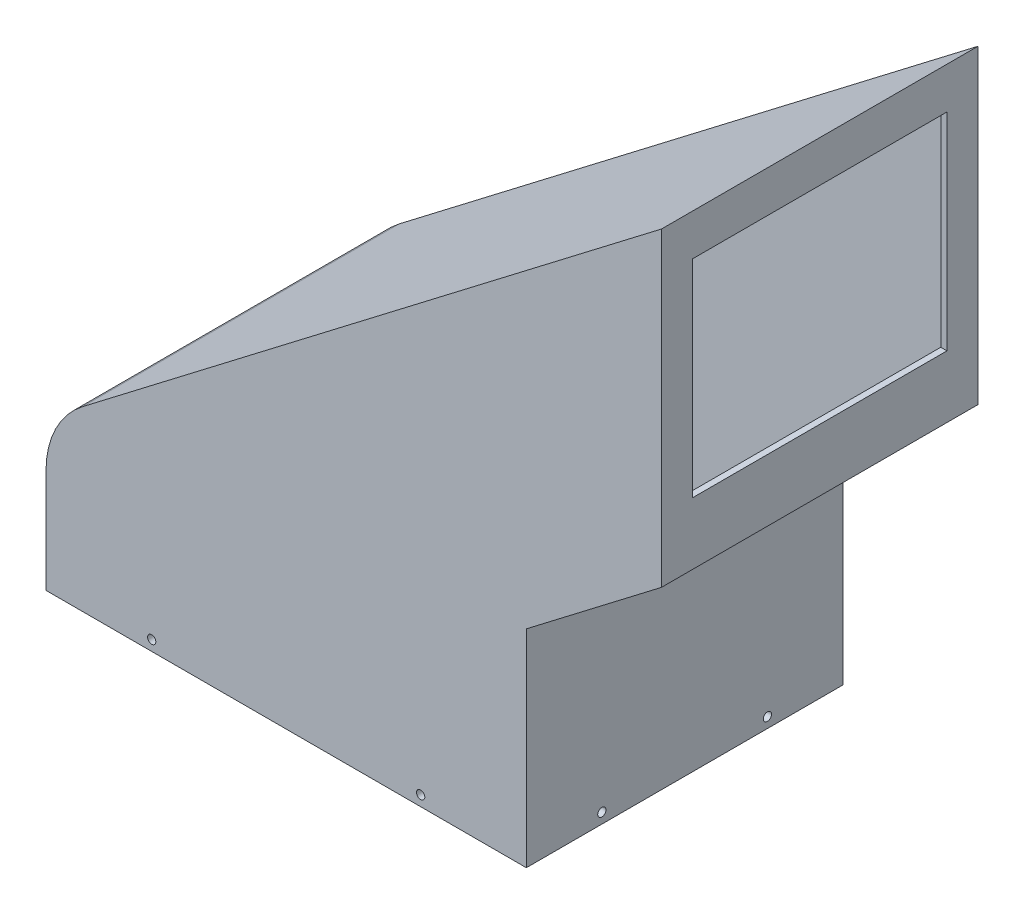
ISO-10303-21;
HEADER;
FILE_DESCRIPTION(('STEP AP214'),'2;1');
FILE_NAME('part.step','',(''),(''),'','','');
FILE_SCHEMA(('AUTOMOTIVE_DESIGN { 1 0 10303 214 1 1 1 1 }'));
ENDSEC;
DATA;
#1=APPLICATION_CONTEXT('core data for automotive mechanical design processes');
#2=APPLICATION_PROTOCOL_DEFINITION('international standard','automotive_design',2000,#1);
#3=PRODUCT_CONTEXT('',#1,'mechanical');
#4=PRODUCT('Part','Part','',(#3));
#5=PRODUCT_RELATED_PRODUCT_CATEGORY('part','',(#4));
#6=PRODUCT_DEFINITION_FORMATION('','',#4);
#7=PRODUCT_DEFINITION_CONTEXT('part definition',#1,'design');
#8=PRODUCT_DEFINITION('design','',#6,#7);
#9=PRODUCT_DEFINITION_SHAPE('','',#8);
#10=(LENGTH_UNIT() NAMED_UNIT(*) SI_UNIT(.MILLI.,.METRE.));
#11=(NAMED_UNIT(*) PLANE_ANGLE_UNIT() SI_UNIT($,.RADIAN.));
#12=(NAMED_UNIT(*) SI_UNIT($,.STERADIAN.) SOLID_ANGLE_UNIT());
#13=UNCERTAINTY_MEASURE_WITH_UNIT(LENGTH_MEASURE(1.E-05),#10,'distance_accuracy_value','');
#14=(GEOMETRIC_REPRESENTATION_CONTEXT(3) GLOBAL_UNCERTAINTY_ASSIGNED_CONTEXT((#13)) GLOBAL_UNIT_ASSIGNED_CONTEXT((#10,
#11,#12)) REPRESENTATION_CONTEXT('',''));
#15=CARTESIAN_POINT('',(0.,0.,0.));
#16=DIRECTION('',(0.,0.,1.));
#17=DIRECTION('',(1.,0.,0.));
#18=AXIS2_PLACEMENT_3D('',#15,#16,#17);
#19=CARTESIAN_POINT('',(232.16,0.,153.));
#20=DIRECTION('',(0.,1.,0.));
#21=DIRECTION('',(0.,0.,1.));
#22=AXIS2_PLACEMENT_3D('',#19,#20,#21);
#23=PLANE('',#22);
#24=DIRECTION('',(1.,0.,0.));
#25=VECTOR('',#24,1.);
#26=CARTESIAN_POINT('',(232.16,0.,0.));
#27=LINE('',#26,#25);
#28=CARTESIAN_POINT('',(0.,0.,0.));
#29=VERTEX_POINT('',#28);
#30=CARTESIAN_POINT('',(232.16,0.,0.));
#31=VERTEX_POINT('',#30);
#32=EDGE_CURVE('E252',#29,#31,#27,.T.);
#33=ORIENTED_EDGE('',*,*,#32,.T.);
#34=DIRECTION('',(0.,0.,-1.));
#35=VECTOR('',#34,1.);
#36=CARTESIAN_POINT('',(232.16,0.,153.));
#37=LINE('',#36,#35);
#38=CARTESIAN_POINT('',(232.16,0.,153.));
#39=VERTEX_POINT('',#38);
#40=EDGE_CURVE('E13',#39,#31,#37,.T.);
#41=ORIENTED_EDGE('',*,*,#40,.F.);
#42=DIRECTION('',(1.,0.,0.));
#43=VECTOR('',#42,1.);
#44=CARTESIAN_POINT('',(232.16,0.,153.));
#45=LINE('',#44,#43);
#46=CARTESIAN_POINT('',(0.,0.,153.));
#47=VERTEX_POINT('',#46);
#48=EDGE_CURVE('E259',#47,#39,#45,.T.);
#49=ORIENTED_EDGE('',*,*,#48,.F.);
#50=DIRECTION('',(0.,0.,-1.));
#51=VECTOR('',#50,1.);
#52=CARTESIAN_POINT('',(0.,0.,153.));
#53=LINE('',#52,#51);
#54=EDGE_CURVE('E275',#47,#29,#53,.T.);
#55=ORIENTED_EDGE('',*,*,#54,.T.);
#56=EDGE_LOOP('',(#33,#41,#49,#55));
#57=FACE_BOUND('',#56,.T.);
#58=DIRECTION('',(1.,0.,0.));
#59=VECTOR('',#58,1.);
#60=CARTESIAN_POINT('',(45.,0.,3.));
#61=LINE('',#60,#59);
#62=CARTESIAN_POINT('',(3.,0.,3.));
#63=VERTEX_POINT('',#62);
#64=CARTESIAN_POINT('',(229.16,0.,3.));
#65=VERTEX_POINT('',#64);
#66=EDGE_CURVE('E186',#63,#65,#61,.T.);
#67=ORIENTED_EDGE('',*,*,#66,.F.);
#68=DIRECTION('',(0.,0.,-1.));
#69=VECTOR('',#68,1.);
#70=CARTESIAN_POINT('',(3.,0.,153.));
#71=LINE('',#70,#69);
#72=CARTESIAN_POINT('',(3.,0.,150.));
#73=VERTEX_POINT('',#72);
#74=EDGE_CURVE('E244',#73,#63,#71,.T.);
#75=ORIENTED_EDGE('',*,*,#74,.F.);
#76=DIRECTION('',(1.,0.,0.));
#77=VECTOR('',#76,1.);
#78=CARTESIAN_POINT('',(45.,0.,150.));
#79=LINE('',#78,#77);
#80=CARTESIAN_POINT('',(229.16,0.,150.));
#81=VERTEX_POINT('',#80);
#82=EDGE_CURVE('E218',#73,#81,#79,.T.);
#83=ORIENTED_EDGE('',*,*,#82,.T.);
#84=DIRECTION('',(0.,0.,-1.));
#85=VECTOR('',#84,1.);
#86=CARTESIAN_POINT('',(229.16,0.,153.));
#87=LINE('',#86,#85);
#88=EDGE_CURVE('E213',#81,#65,#87,.T.);
#89=ORIENTED_EDGE('',*,*,#88,.T.);
#90=EDGE_LOOP('',(#67,#75,#83,#89));
#91=FACE_BOUND('',#90,.T.);
#92=ADVANCED_FACE('F43',(#57,#91),#23,.F.);
#93=CARTESIAN_POINT('',(232.16,100.,153.));
#94=DIRECTION('',(-1.,0.,0.));
#95=DIRECTION('',(0.,0.,1.));
#96=AXIS2_PLACEMENT_3D('',#93,#94,#95);
#97=PLANE('',#96);
#98=CARTESIAN_POINT('',(232.16,4.99999999999984,116.5));
#99=DIRECTION('',(1.,0.,0.));
#100=DIRECTION('',(0.,0.,-1.));
#101=AXIS2_PLACEMENT_3D('',#98,#99,#100);
#102=CIRCLE('',#101,2.);
#103=CARTESIAN_POINT('',(232.16,4.99999999999984,114.5));
#104=VERTEX_POINT('',#103);
#105=EDGE_CURVE('E675',#104,#104,#102,.T.);
#106=ORIENTED_EDGE('',*,*,#105,.F.);
#107=EDGE_LOOP('',(#106));
#108=FACE_BOUND('',#107,.T.);
#109=CARTESIAN_POINT('',(232.16,4.99999999999984,36.5));
#110=DIRECTION('',(1.,0.,0.));
#111=DIRECTION('',(0.,0.,-1.));
#112=AXIS2_PLACEMENT_3D('',#109,#110,#111);
#113=CIRCLE('',#112,2.);
#114=CARTESIAN_POINT('',(232.16,4.99999999999984,34.5));
#115=VERTEX_POINT('',#114);
#116=EDGE_CURVE('E323',#115,#115,#113,.T.);
#117=ORIENTED_EDGE('',*,*,#116,.F.);
#118=EDGE_LOOP('',(#117));
#119=FACE_BOUND('',#118,.T.);
#120=DIRECTION('',(0.,1.,0.));
#121=VECTOR('',#120,1.);
#122=CARTESIAN_POINT('',(232.16,100.,0.));
#123=LINE('',#122,#121);
#124=CARTESIAN_POINT('',(232.16,100.,0.));
#125=VERTEX_POINT('',#124);
#126=EDGE_CURVE('E278',#31,#125,#123,.T.);
#127=ORIENTED_EDGE('',*,*,#126,.T.);
#128=DIRECTION('',(0.,0.,-1.));
#129=VECTOR('',#128,1.);
#130=CARTESIAN_POINT('',(232.16,100.,153.));
#131=LINE('',#130,#129);
#132=CARTESIAN_POINT('',(232.16,100.,153.));
#133=VERTEX_POINT('',#132);
#134=EDGE_CURVE('E51',#133,#125,#131,.T.);
#135=ORIENTED_EDGE('',*,*,#134,.F.);
#136=DIRECTION('',(0.,1.,0.));
#137=VECTOR('',#136,1.);
#138=CARTESIAN_POINT('',(232.16,100.,153.));
#139=LINE('',#138,#137);
#140=EDGE_CURVE('E262',#39,#133,#139,.T.);
#141=ORIENTED_EDGE('',*,*,#140,.F.);
#142=ORIENTED_EDGE('',*,*,#40,.T.);
#143=EDGE_LOOP('',(#127,#135,#141,#142));
#144=FACE_BOUND('',#143,.T.);
#145=ADVANCED_FACE('F404',(#108,#119,#144),#97,.F.);
#146=CARTESIAN_POINT('',(297.453814859582,150.,153.));
#147=DIRECTION('',(-0.607982736823278,0.793950245119224,0.));
#148=DIRECTION('',(-0.793950245119224,-0.607982736823279,0.));
#149=AXIS2_PLACEMENT_3D('',#146,#147,#148);
#150=PLANE('',#149);
#151=DIRECTION('',(0.793950245119224,0.607982736823278,0.));
#152=VECTOR('',#151,1.);
#153=CARTESIAN_POINT('',(297.453814859582,150.,0.));
#154=LINE('',#153,#152);
#155=CARTESIAN_POINT('',(297.453814859582,150.,0.));
#156=VERTEX_POINT('',#155);
#157=EDGE_CURVE('E280',#125,#156,#154,.T.);
#158=ORIENTED_EDGE('',*,*,#157,.T.);
#159=DIRECTION('',(0.,0.,-1.));
#160=VECTOR('',#159,1.);
#161=CARTESIAN_POINT('',(297.453814859582,150.,153.));
#162=LINE('',#161,#160);
#163=CARTESIAN_POINT('',(297.453814859582,150.,153.));
#164=VERTEX_POINT('',#163);
#165=EDGE_CURVE('E300',#164,#156,#162,.T.);
#166=ORIENTED_EDGE('',*,*,#165,.F.);
#167=DIRECTION('',(0.793950245119224,0.607982736823278,0.));
#168=VECTOR('',#167,1.);
#169=CARTESIAN_POINT('',(297.453814859582,150.,153.));
#170=LINE('',#169,#168);
#171=EDGE_CURVE('E265',#133,#164,#170,.T.);
#172=ORIENTED_EDGE('',*,*,#171,.F.);
#173=ORIENTED_EDGE('',*,*,#134,.T.);
#174=EDGE_LOOP('',(#158,#166,#172,#173));
#175=FACE_BOUND('',#174,.T.);
#176=ADVANCED_FACE('F409',(#175),#150,.F.);
#177=CARTESIAN_POINT('',(297.453814859582,300.,153.));
#178=DIRECTION('',(-1.,0.,0.));
#179=DIRECTION('',(0.,0.,1.));
#180=AXIS2_PLACEMENT_3D('',#177,#178,#179);
#181=PLANE('',#180);
#182=DIRECTION('',(0.,0.,-1.));
#183=VECTOR('',#182,1.);
#184=CARTESIAN_POINT('',(297.453814859582,180.,138.));
#185=LINE('',#184,#183);
#186=CARTESIAN_POINT('',(297.453814859582,180.,138.));
#187=VERTEX_POINT('',#186);
#188=CARTESIAN_POINT('',(297.453814859582,180.,15.));
#189=VERTEX_POINT('',#188);
#190=EDGE_CURVE('E192',#187,#189,#185,.T.);
#191=ORIENTED_EDGE('',*,*,#190,.F.);
#192=DIRECTION('',(0.,-1.,0.));
#193=VECTOR('',#192,1.);
#194=CARTESIAN_POINT('',(297.453814859582,280.,138.));
#195=LINE('',#194,#193);
#196=CARTESIAN_POINT('',(297.453814859582,280.,138.));
#197=VERTEX_POINT('',#196);
#198=EDGE_CURVE('E59',#197,#187,#195,.T.);
#199=ORIENTED_EDGE('',*,*,#198,.F.);
#200=DIRECTION('',(0.,0.,1.));
#201=VECTOR('',#200,1.);
#202=CARTESIAN_POINT('',(297.453814859582,280.,138.));
#203=LINE('',#202,#201);
#204=CARTESIAN_POINT('',(297.453814859582,280.,15.));
#205=VERTEX_POINT('',#204);
#206=EDGE_CURVE('E179',#205,#197,#203,.T.);
#207=ORIENTED_EDGE('',*,*,#206,.F.);
#208=DIRECTION('',(0.,1.,0.));
#209=VECTOR('',#208,1.);
#210=CARTESIAN_POINT('',(297.453814859582,280.,15.));
#211=LINE('',#210,#209);
#212=EDGE_CURVE('E187',#189,#205,#211,.T.);
#213=ORIENTED_EDGE('',*,*,#212,.F.);
#214=EDGE_LOOP('',(#191,#199,#207,#213));
#215=FACE_BOUND('',#214,.T.);
#216=DIRECTION('',(0.,1.,0.));
#217=VECTOR('',#216,1.);
#218=CARTESIAN_POINT('',(297.453814859582,300.,0.));
#219=LINE('',#218,#217);
#220=CARTESIAN_POINT('',(297.453814859582,300.,0.));
#221=VERTEX_POINT('',#220);
#222=EDGE_CURVE('E282',#156,#221,#219,.T.);
#223=ORIENTED_EDGE('',*,*,#222,.T.);
#224=DIRECTION('',(0.,0.,-1.));
#225=VECTOR('',#224,1.);
#226=CARTESIAN_POINT('',(297.453814859582,300.,153.));
#227=LINE('',#226,#225);
#228=CARTESIAN_POINT('',(297.453814859582,300.,153.));
#229=VERTEX_POINT('',#228);
#230=EDGE_CURVE('E297',#229,#221,#227,.T.);
#231=ORIENTED_EDGE('',*,*,#230,.F.);
#232=DIRECTION('',(0.,1.,0.));
#233=VECTOR('',#232,1.);
#234=CARTESIAN_POINT('',(297.453814859582,300.,153.));
#235=LINE('',#234,#233);
#236=EDGE_CURVE('E267',#164,#229,#235,.T.);
#237=ORIENTED_EDGE('',*,*,#236,.F.);
#238=ORIENTED_EDGE('',*,*,#165,.T.);
#239=EDGE_LOOP('',(#223,#231,#237,#238));
#240=FACE_BOUND('',#239,.T.);
#241=ADVANCED_FACE('F190',(#215,#240),#181,.F.);
#242=CARTESIAN_POINT('',(17.6407768429525,85.7277610303651,153.));
#243=DIRECTION('',(0.607982736823279,-0.793950245119224,0.));
#244=DIRECTION('',(0.793950245119224,0.607982736823279,0.));
#245=AXIS2_PLACEMENT_3D('',#242,#243,#244);
#246=PLANE('',#245);
#247=DIRECTION('',(-0.793950245119224,-0.607982736823279,0.));
#248=VECTOR('',#247,1.);
#249=CARTESIAN_POINT('',(17.6407768429525,85.7277610303651,0.));
#250=LINE('',#249,#248);
#251=CARTESIAN_POINT('',(17.6407768429525,85.7277610303651,0.));
#252=VERTEX_POINT('',#251);
#253=EDGE_CURVE('E284',#221,#252,#250,.T.);
#254=ORIENTED_EDGE('',*,*,#253,.T.);
#255=DIRECTION('',(0.,0.,-1.));
#256=VECTOR('',#255,1.);
#257=CARTESIAN_POINT('',(17.6407768429525,85.7277610303651,153.));
#258=LINE('',#257,#256);
#259=CARTESIAN_POINT('',(17.6407768429525,85.7277610303651,153.));
#260=VERTEX_POINT('',#259);
#261=EDGE_CURVE('E294',#260,#252,#258,.T.);
#262=ORIENTED_EDGE('',*,*,#261,.F.);
#263=DIRECTION('',(-0.793950245119224,-0.607982736823279,0.));
#264=VECTOR('',#263,1.);
#265=CARTESIAN_POINT('',(17.6407768429525,85.7277610303651,153.));
#266=LINE('',#265,#264);
#267=EDGE_CURVE('E269',#229,#260,#266,.T.);
#268=ORIENTED_EDGE('',*,*,#267,.F.);
#269=ORIENTED_EDGE('',*,*,#230,.T.);
#270=EDGE_LOOP('',(#254,#262,#268,#269));
#271=FACE_BOUND('',#270,.T.);
#272=ADVANCED_FACE('F434',(#271),#246,.F.);
#273=CARTESIAN_POINT('',(45.,50.,153.));
#274=DIRECTION('',(0.,0.,-1.));
#275=DIRECTION('',(-1.,0.,0.));
#276=AXIS2_PLACEMENT_3D('',#273,#274,#275);
#277=CYLINDRICAL_SURFACE('',#276,45.);
#278=CARTESIAN_POINT('',(45.,50.,0.));
#279=DIRECTION('',(0.,0.,1.));
#280=DIRECTION('',(-1.,0.,0.));
#281=AXIS2_PLACEMENT_3D('',#278,#279,#280);
#282=CIRCLE('',#281,45.);
#283=CARTESIAN_POINT('',(0.,50.,0.));
#284=VERTEX_POINT('',#283);
#285=EDGE_CURVE('E286',#252,#284,#282,.T.);
#286=ORIENTED_EDGE('',*,*,#285,.T.);
#287=DIRECTION('',(0.,0.,-1.));
#288=VECTOR('',#287,1.);
#289=CARTESIAN_POINT('',(0.,50.,153.));
#290=LINE('',#289,#288);
#291=CARTESIAN_POINT('',(0.,50.,153.));
#292=VERTEX_POINT('',#291);
#293=EDGE_CURVE('E291',#292,#284,#290,.T.);
#294=ORIENTED_EDGE('',*,*,#293,.F.);
#295=CARTESIAN_POINT('',(45.,50.,153.));
#296=DIRECTION('',(0.,0.,1.));
#297=DIRECTION('',(-1.,0.,0.));
#298=AXIS2_PLACEMENT_3D('',#295,#296,#297);
#299=CIRCLE('',#298,45.);
#300=EDGE_CURVE('E271',#260,#292,#299,.T.);
#301=ORIENTED_EDGE('',*,*,#300,.F.);
#302=ORIENTED_EDGE('',*,*,#261,.T.);
#303=EDGE_LOOP('',(#286,#294,#301,#302));
#304=FACE_BOUND('',#303,.T.);
#305=ADVANCED_FACE('F430',(#304),#277,.T.);
#306=CARTESIAN_POINT('',(0.,0.,153.));
#307=DIRECTION('',(1.,0.,0.));
#308=DIRECTION('',(0.,0.,-1.));
#309=AXIS2_PLACEMENT_3D('',#306,#307,#308);
#310=PLANE('',#309);
#311=CARTESIAN_POINT('',(0.,4.99999999999984,116.5));
#312=DIRECTION('',(1.,0.,0.));
#313=DIRECTION('',(0.,0.,-1.));
#314=AXIS2_PLACEMENT_3D('',#311,#312,#313);
#315=CIRCLE('',#314,2.);
#316=CARTESIAN_POINT('',(0.,4.99999999999984,114.5));
#317=VERTEX_POINT('',#316);
#318=EDGE_CURVE('E676',#317,#317,#315,.T.);
#319=ORIENTED_EDGE('',*,*,#318,.T.);
#320=EDGE_LOOP('',(#319));
#321=FACE_BOUND('',#320,.T.);
#322=CARTESIAN_POINT('',(0.,4.99999999999984,36.5));
#323=DIRECTION('',(1.,0.,0.));
#324=DIRECTION('',(0.,0.,-1.));
#325=AXIS2_PLACEMENT_3D('',#322,#323,#324);
#326=CIRCLE('',#325,2.);
#327=CARTESIAN_POINT('',(0.,4.99999999999984,34.5));
#328=VERTEX_POINT('',#327);
#329=EDGE_CURVE('E316',#328,#328,#326,.T.);
#330=ORIENTED_EDGE('',*,*,#329,.T.);
#331=EDGE_LOOP('',(#330));
#332=FACE_BOUND('',#331,.T.);
#333=DIRECTION('',(0.,-1.,0.));
#334=VECTOR('',#333,1.);
#335=CARTESIAN_POINT('',(0.,0.,0.));
#336=LINE('',#335,#334);
#337=EDGE_CURVE('E263',#284,#29,#336,.T.);
#338=ORIENTED_EDGE('',*,*,#337,.T.);
#339=ORIENTED_EDGE('',*,*,#54,.F.);
#340=DIRECTION('',(0.,-1.,0.));
#341=VECTOR('',#340,1.);
#342=CARTESIAN_POINT('',(0.,0.,153.));
#343=LINE('',#342,#341);
#344=EDGE_CURVE('E273',#292,#47,#343,.T.);
#345=ORIENTED_EDGE('',*,*,#344,.F.);
#346=ORIENTED_EDGE('',*,*,#293,.T.);
#347=EDGE_LOOP('',(#338,#339,#345,#346));
#348=FACE_BOUND('',#347,.T.);
#349=ADVANCED_FACE('F428',(#321,#332,#348),#310,.F.);
#350=CARTESIAN_POINT('',(45.,50.,153.));
#351=DIRECTION('',(0.,0.,-1.));
#352=DIRECTION('',(-1.,0.,0.));
#353=AXIS2_PLACEMENT_3D('',#350,#351,#352);
#354=PLANE('',#353);
#355=CARTESIAN_POINT('',(51.0800000000003,4.99999999999984,153.));
#356=DIRECTION('',(0.,0.,1.));
#357=DIRECTION('',(1.,0.,0.));
#358=AXIS2_PLACEMENT_3D('',#355,#356,#357);
#359=CIRCLE('',#358,2.);
#360=CARTESIAN_POINT('',(53.0800000000003,4.99999999999984,153.));
#361=VERTEX_POINT('',#360);
#362=EDGE_CURVE('E320',#361,#361,#359,.T.);
#363=ORIENTED_EDGE('',*,*,#362,.F.);
#364=EDGE_LOOP('',(#363));
#365=FACE_BOUND('',#364,.T.);
#366=CARTESIAN_POINT('',(181.08,4.99999999999978,153.));
#367=DIRECTION('',(0.,0.,1.));
#368=DIRECTION('',(1.,0.,0.));
#369=AXIS2_PLACEMENT_3D('',#366,#367,#368);
#370=CIRCLE('',#369,2.);
#371=CARTESIAN_POINT('',(183.08,4.99999999999978,153.));
#372=VERTEX_POINT('',#371);
#373=EDGE_CURVE('E339',#372,#372,#370,.T.);
#374=ORIENTED_EDGE('',*,*,#373,.F.);
#375=EDGE_LOOP('',(#374));
#376=FACE_BOUND('',#375,.T.);
#377=ORIENTED_EDGE('',*,*,#48,.T.);
#378=ORIENTED_EDGE('',*,*,#140,.T.);
#379=ORIENTED_EDGE('',*,*,#171,.T.);
#380=ORIENTED_EDGE('',*,*,#236,.T.);
#381=ORIENTED_EDGE('',*,*,#267,.T.);
#382=ORIENTED_EDGE('',*,*,#300,.T.);
#383=ORIENTED_EDGE('',*,*,#344,.T.);
#384=EDGE_LOOP('',(#377,#378,#379,#380,#381,#382,#383));
#385=FACE_BOUND('',#384,.T.);
#386=ADVANCED_FACE('F397',(#365,#376,#385),#354,.F.);
#387=CARTESIAN_POINT('',(45.,50.,0.));
#388=DIRECTION('',(0.,0.,-1.));
#389=DIRECTION('',(-1.,0.,0.));
#390=AXIS2_PLACEMENT_3D('',#387,#388,#389);
#391=PLANE('',#390);
#392=CARTESIAN_POINT('',(51.0800000000003,4.99999999999984,0.));
#393=DIRECTION('',(0.,0.,1.));
#394=DIRECTION('',(1.,0.,0.));
#395=AXIS2_PLACEMENT_3D('',#392,#393,#394);
#396=CIRCLE('',#395,2.);
#397=CARTESIAN_POINT('',(53.0800000000003,4.99999999999984,0.));
#398=VERTEX_POINT('',#397);
#399=EDGE_CURVE('E312',#398,#398,#396,.T.);
#400=ORIENTED_EDGE('',*,*,#399,.T.);
#401=EDGE_LOOP('',(#400));
#402=FACE_BOUND('',#401,.T.);
#403=CARTESIAN_POINT('',(181.08,4.99999999999978,0.));
#404=DIRECTION('',(0.,0.,1.));
#405=DIRECTION('',(1.,0.,0.));
#406=AXIS2_PLACEMENT_3D('',#403,#404,#405);
#407=CIRCLE('',#406,2.);
#408=CARTESIAN_POINT('',(183.08,4.99999999999978,0.));
#409=VERTEX_POINT('',#408);
#410=EDGE_CURVE('E308',#409,#409,#407,.T.);
#411=ORIENTED_EDGE('',*,*,#410,.T.);
#412=EDGE_LOOP('',(#411));
#413=FACE_BOUND('',#412,.T.);
#414=ORIENTED_EDGE('',*,*,#32,.F.);
#415=ORIENTED_EDGE('',*,*,#337,.F.);
#416=ORIENTED_EDGE('',*,*,#285,.F.);
#417=ORIENTED_EDGE('',*,*,#253,.F.);
#418=ORIENTED_EDGE('',*,*,#222,.F.);
#419=ORIENTED_EDGE('',*,*,#157,.F.);
#420=ORIENTED_EDGE('',*,*,#126,.F.);
#421=EDGE_LOOP('',(#414,#415,#416,#417,#418,#419,#420));
#422=FACE_BOUND('',#421,.T.);
#423=ADVANCED_FACE('F389',(#402,#413,#422),#391,.T.);
#424=CARTESIAN_POINT('',(229.16,100.,153.));
#425=DIRECTION('',(-1.,0.,0.));
#426=DIRECTION('',(0.,0.,1.));
#427=AXIS2_PLACEMENT_3D('',#424,#425,#426);
#428=PLANE('',#427);
#429=CARTESIAN_POINT('',(229.16,4.99999999999984,116.5));
#430=DIRECTION('',(-1.,0.,0.));
#431=DIRECTION('',(0.,0.,1.));
#432=AXIS2_PLACEMENT_3D('',#429,#430,#431);
#433=CIRCLE('',#432,2.);
#434=CARTESIAN_POINT('',(229.16,4.99999999999984,118.5));
#435=VERTEX_POINT('',#434);
#436=EDGE_CURVE('E328',#435,#435,#433,.T.);
#437=ORIENTED_EDGE('',*,*,#436,.F.);
#438=EDGE_LOOP('',(#437));
#439=FACE_BOUND('',#438,.T.);
#440=CARTESIAN_POINT('',(229.16,4.99999999999984,36.5));
#441=DIRECTION('',(-1.,0.,0.));
#442=DIRECTION('',(0.,0.,1.));
#443=AXIS2_PLACEMENT_3D('',#440,#441,#442);
#444=CIRCLE('',#443,2.);
#445=CARTESIAN_POINT('',(229.16,4.99999999999984,38.5));
#446=VERTEX_POINT('',#445);
#447=EDGE_CURVE('E315',#446,#446,#444,.T.);
#448=ORIENTED_EDGE('',*,*,#447,.F.);
#449=EDGE_LOOP('',(#448));
#450=FACE_BOUND('',#449,.T.);
#451=DIRECTION('',(0.,1.,0.));
#452=VECTOR('',#451,1.);
#453=CARTESIAN_POINT('',(229.16,50.,3.));
#454=LINE('',#453,#452);
#455=CARTESIAN_POINT('',(229.16,101.481266359901,3.));
#456=VERTEX_POINT('',#455);
#457=EDGE_CURVE('E207',#65,#456,#454,.T.);
#458=ORIENTED_EDGE('',*,*,#457,.F.);
#459=ORIENTED_EDGE('',*,*,#88,.F.);
#460=DIRECTION('',(0.,1.,0.));
#461=VECTOR('',#460,1.);
#462=CARTESIAN_POINT('',(229.16,50.,150.));
#463=LINE('',#462,#461);
#464=CARTESIAN_POINT('',(229.16,101.481266359901,150.));
#465=VERTEX_POINT('',#464);
#466=EDGE_CURVE('E215',#81,#465,#463,.T.);
#467=ORIENTED_EDGE('',*,*,#466,.T.);
#468=DIRECTION('',(0.,0.,-1.));
#469=VECTOR('',#468,1.);
#470=CARTESIAN_POINT('',(229.16,101.481266359901,153.));
#471=LINE('',#470,#469);
#472=EDGE_CURVE('E210',#465,#456,#471,.T.);
#473=ORIENTED_EDGE('',*,*,#472,.T.);
#474=EDGE_LOOP('',(#458,#459,#467,#473));
#475=FACE_BOUND('',#474,.T.);
#476=ADVANCED_FACE('F387',(#439,#450,#475),#428,.T.);
#477=CARTESIAN_POINT('',(295.629866649112,152.381850735358,153.));
#478=DIRECTION('',(-0.607982736823278,0.793950245119224,0.));
#479=DIRECTION('',(-0.793950245119224,-0.607982736823279,0.));
#480=AXIS2_PLACEMENT_3D('',#477,#478,#479);
#481=PLANE('',#480);
#482=DIRECTION('',(0.793950245119224,0.607982736823279,0.));
#483=VECTOR('',#482,1.);
#484=CARTESIAN_POINT('',(88.2230350718474,-6.44393699300864,3.));
#485=LINE('',#484,#483);
#486=CARTESIAN_POINT('',(294.453814859582,151.481266359901,3.));
#487=VERTEX_POINT('',#486);
#488=EDGE_CURVE('E209',#456,#487,#485,.T.);
#489=ORIENTED_EDGE('',*,*,#488,.F.);
#490=ORIENTED_EDGE('',*,*,#472,.F.);
#491=DIRECTION('',(0.793950245119224,0.607982736823279,0.));
#492=VECTOR('',#491,1.);
#493=CARTESIAN_POINT('',(88.2230350718474,-6.44393699300864,150.));
#494=LINE('',#493,#492);
#495=CARTESIAN_POINT('',(294.453814859582,151.481266359901,150.));
#496=VERTEX_POINT('',#495);
#497=EDGE_CURVE('E217',#465,#496,#494,.T.);
#498=ORIENTED_EDGE('',*,*,#497,.T.);
#499=DIRECTION('',(0.,0.,-1.));
#500=VECTOR('',#499,1.);
#501=CARTESIAN_POINT('',(294.453814859582,151.481266359901,153.));
#502=LINE('',#501,#500);
#503=EDGE_CURVE('E214',#496,#487,#502,.T.);
#504=ORIENTED_EDGE('',*,*,#503,.T.);
#505=EDGE_LOOP('',(#489,#490,#498,#504));
#506=FACE_BOUND('',#505,.T.);
#507=ADVANCED_FACE('F355',(#506),#481,.T.);
#508=CARTESIAN_POINT('',(294.453814859582,300.,153.));
#509=DIRECTION('',(-1.,0.,0.));
#510=DIRECTION('',(0.,0.,1.));
#511=AXIS2_PLACEMENT_3D('',#508,#509,#510);
#512=PLANE('',#511);
#513=DIRECTION('',(0.,-1.,0.));
#514=VECTOR('',#513,1.);
#515=CARTESIAN_POINT('',(294.453814859582,280.,138.));
#516=LINE('',#515,#514);
#517=CARTESIAN_POINT('',(294.453814859582,280.,138.));
#518=VERTEX_POINT('',#517);
#519=CARTESIAN_POINT('',(294.453814859582,180.,138.));
#520=VERTEX_POINT('',#519);
#521=EDGE_CURVE('E172',#518,#520,#516,.T.);
#522=ORIENTED_EDGE('',*,*,#521,.T.);
#523=DIRECTION('',(0.,0.,-1.));
#524=VECTOR('',#523,1.);
#525=CARTESIAN_POINT('',(294.453814859582,180.,138.));
#526=LINE('',#525,#524);
#527=CARTESIAN_POINT('',(294.453814859582,180.,15.));
#528=VERTEX_POINT('',#527);
#529=EDGE_CURVE('E195',#520,#528,#526,.T.);
#530=ORIENTED_EDGE('',*,*,#529,.T.);
#531=DIRECTION('',(0.,1.,0.));
#532=VECTOR('',#531,1.);
#533=CARTESIAN_POINT('',(294.453814859582,280.,15.));
#534=LINE('',#533,#532);
#535=CARTESIAN_POINT('',(294.453814859582,280.,15.));
#536=VERTEX_POINT('',#535);
#537=EDGE_CURVE('E175',#528,#536,#534,.T.);
#538=ORIENTED_EDGE('',*,*,#537,.T.);
#539=DIRECTION('',(0.,0.,1.));
#540=VECTOR('',#539,1.);
#541=CARTESIAN_POINT('',(294.453814859582,280.,138.));
#542=LINE('',#541,#540);
#543=EDGE_CURVE('E176',#536,#518,#542,.T.);
#544=ORIENTED_EDGE('',*,*,#543,.T.);
#545=EDGE_LOOP('',(#522,#530,#538,#544));
#546=FACE_BOUND('',#545,.T.);
#547=DIRECTION('',(0.,1.,0.));
#548=VECTOR('',#547,1.);
#549=CARTESIAN_POINT('',(294.453814859582,50.,3.));
#550=LINE('',#549,#548);
#551=CARTESIAN_POINT('',(294.453814859582,293.924117738958,3.));
#552=VERTEX_POINT('',#551);
#553=EDGE_CURVE('E220',#487,#552,#550,.T.);
#554=ORIENTED_EDGE('',*,*,#553,.F.);
#555=ORIENTED_EDGE('',*,*,#503,.F.);
#556=DIRECTION('',(0.,1.,0.));
#557=VECTOR('',#556,1.);
#558=CARTESIAN_POINT('',(294.453814859582,50.,150.));
#559=LINE('',#558,#557);
#560=CARTESIAN_POINT('',(294.453814859582,293.924117738958,150.));
#561=VERTEX_POINT('',#560);
#562=EDGE_CURVE('E225',#496,#561,#559,.T.);
#563=ORIENTED_EDGE('',*,*,#562,.T.);
#564=DIRECTION('',(0.,0.,-1.));
#565=VECTOR('',#564,1.);
#566=CARTESIAN_POINT('',(294.453814859582,293.924117738958,153.));
#567=LINE('',#566,#565);
#568=EDGE_CURVE('E223',#561,#552,#567,.T.);
#569=ORIENTED_EDGE('',*,*,#568,.T.);
#570=EDGE_LOOP('',(#554,#555,#563,#569));
#571=FACE_BOUND('',#570,.T.);
#572=ADVANCED_FACE('F351',(#546,#571),#512,.T.);
#573=CARTESIAN_POINT('',(19.4647250534223,83.3459102950074,153.));
#574=DIRECTION('',(0.607982736823279,-0.793950245119224,0.));
#575=DIRECTION('',(0.793950245119224,0.607982736823279,0.));
#576=AXIS2_PLACEMENT_3D('',#573,#574,#575);
#577=PLANE('',#576);
#578=DIRECTION('',(-0.793950245119224,-0.607982736823279,0.));
#579=VECTOR('',#578,1.);
#580=CARTESIAN_POINT('',(19.4647250534223,83.3459102950074,3.));
#581=LINE('',#580,#579);
#582=CARTESIAN_POINT('',(19.4647250534223,83.3459102950074,3.));
#583=VERTEX_POINT('',#582);
#584=EDGE_CURVE('E227',#552,#583,#581,.T.);
#585=ORIENTED_EDGE('',*,*,#584,.F.);
#586=ORIENTED_EDGE('',*,*,#568,.F.);
#587=DIRECTION('',(-0.793950245119224,-0.607982736823279,0.));
#588=VECTOR('',#587,1.);
#589=CARTESIAN_POINT('',(19.4647250534223,83.3459102950074,150.));
#590=LINE('',#589,#588);
#591=CARTESIAN_POINT('',(19.4647250534223,83.3459102950074,150.));
#592=VERTEX_POINT('',#591);
#593=EDGE_CURVE('E232',#561,#592,#590,.T.);
#594=ORIENTED_EDGE('',*,*,#593,.T.);
#595=DIRECTION('',(0.,0.,-1.));
#596=VECTOR('',#595,1.);
#597=CARTESIAN_POINT('',(19.4647250534223,83.3459102950074,153.));
#598=LINE('',#597,#596);
#599=EDGE_CURVE('E230',#592,#583,#598,.T.);
#600=ORIENTED_EDGE('',*,*,#599,.T.);
#601=EDGE_LOOP('',(#585,#586,#594,#600));
#602=FACE_BOUND('',#601,.T.);
#603=ADVANCED_FACE('F354',(#602),#577,.T.);
#604=CARTESIAN_POINT('',(45.,50.,153.));
#605=DIRECTION('',(0.,0.,-1.));
#606=DIRECTION('',(-1.,0.,0.));
#607=AXIS2_PLACEMENT_3D('',#604,#605,#606);
#608=CYLINDRICAL_SURFACE('',#607,42.);
#609=CARTESIAN_POINT('',(45.,50.,3.));
#610=DIRECTION('',(0.,0.,-1.));
#611=DIRECTION('',(-1.,0.,0.));
#612=AXIS2_PLACEMENT_3D('',#609,#610,#611);
#613=CIRCLE('',#612,42.);
#614=CARTESIAN_POINT('',(3.,50.,3.));
#615=VERTEX_POINT('',#614);
#616=EDGE_CURVE('E234',#583,#615,#613,.F.);
#617=ORIENTED_EDGE('',*,*,#616,.F.);
#618=ORIENTED_EDGE('',*,*,#599,.F.);
#619=CARTESIAN_POINT('',(45.,50.,150.));
#620=DIRECTION('',(0.,0.,-1.));
#621=DIRECTION('',(-1.,0.,0.));
#622=AXIS2_PLACEMENT_3D('',#619,#620,#621);
#623=CIRCLE('',#622,42.);
#624=CARTESIAN_POINT('',(3.,50.,150.));
#625=VERTEX_POINT('',#624);
#626=EDGE_CURVE('E239',#592,#625,#623,.F.);
#627=ORIENTED_EDGE('',*,*,#626,.T.);
#628=DIRECTION('',(0.,0.,-1.));
#629=VECTOR('',#628,1.);
#630=CARTESIAN_POINT('',(3.,50.,153.));
#631=LINE('',#630,#629);
#632=EDGE_CURVE('E237',#625,#615,#631,.T.);
#633=ORIENTED_EDGE('',*,*,#632,.T.);
#634=EDGE_LOOP('',(#617,#618,#627,#633));
#635=FACE_BOUND('',#634,.T.);
#636=ADVANCED_FACE('F377',(#635),#608,.F.);
#637=CARTESIAN_POINT('',(3.,0.,153.));
#638=DIRECTION('',(1.,0.,0.));
#639=DIRECTION('',(0.,0.,-1.));
#640=AXIS2_PLACEMENT_3D('',#637,#638,#639);
#641=PLANE('',#640);
#642=CARTESIAN_POINT('',(3.,4.99999999999984,116.5));
#643=DIRECTION('',(1.,0.,0.));
#644=DIRECTION('',(0.,0.,-1.));
#645=AXIS2_PLACEMENT_3D('',#642,#643,#644);
#646=CIRCLE('',#645,2.);
#647=CARTESIAN_POINT('',(3.,4.99999999999984,114.5));
#648=VERTEX_POINT('',#647);
#649=EDGE_CURVE('E46',#648,#648,#646,.T.);
#650=ORIENTED_EDGE('',*,*,#649,.F.);
#651=EDGE_LOOP('',(#650));
#652=FACE_BOUND('',#651,.T.);
#653=CARTESIAN_POINT('',(3.,4.99999999999984,36.5));
#654=DIRECTION('',(1.,0.,0.));
#655=DIRECTION('',(0.,0.,-1.));
#656=AXIS2_PLACEMENT_3D('',#653,#654,#655);
#657=CIRCLE('',#656,2.);
#658=CARTESIAN_POINT('',(3.,4.99999999999984,34.5));
#659=VERTEX_POINT('',#658);
#660=EDGE_CURVE('E313',#659,#659,#657,.T.);
#661=ORIENTED_EDGE('',*,*,#660,.F.);
#662=EDGE_LOOP('',(#661));
#663=FACE_BOUND('',#662,.T.);
#664=DIRECTION('',(0.,-1.,0.));
#665=VECTOR('',#664,1.);
#666=CARTESIAN_POINT('',(3.,50.,3.));
#667=LINE('',#666,#665);
#668=EDGE_CURVE('E241',#615,#63,#667,.T.);
#669=ORIENTED_EDGE('',*,*,#668,.F.);
#670=ORIENTED_EDGE('',*,*,#632,.F.);
#671=DIRECTION('',(0.,-1.,0.));
#672=VECTOR('',#671,1.);
#673=CARTESIAN_POINT('',(3.,50.,150.));
#674=LINE('',#673,#672);
#675=EDGE_CURVE('E246',#625,#73,#674,.T.);
#676=ORIENTED_EDGE('',*,*,#675,.T.);
#677=ORIENTED_EDGE('',*,*,#74,.T.);
#678=EDGE_LOOP('',(#669,#670,#676,#677));
#679=FACE_BOUND('',#678,.T.);
#680=ADVANCED_FACE('F383',(#652,#663,#679),#641,.T.);
#681=CARTESIAN_POINT('',(45.,50.,150.));
#682=DIRECTION('',(0.,0.,-1.));
#683=DIRECTION('',(-1.,0.,0.));
#684=AXIS2_PLACEMENT_3D('',#681,#682,#683);
#685=PLANE('',#684);
#686=CARTESIAN_POINT('',(51.0800000000003,4.99999999999984,150.));
#687=DIRECTION('',(0.,0.,-1.));
#688=DIRECTION('',(-1.,0.,0.));
#689=AXIS2_PLACEMENT_3D('',#686,#687,#688);
#690=CIRCLE('',#689,2.);
#691=CARTESIAN_POINT('',(49.0800000000004,4.99999999999984,150.));
#692=VERTEX_POINT('',#691);
#693=EDGE_CURVE('E311',#692,#692,#690,.T.);
#694=ORIENTED_EDGE('',*,*,#693,.F.);
#695=EDGE_LOOP('',(#694));
#696=FACE_BOUND('',#695,.T.);
#697=CARTESIAN_POINT('',(181.08,4.99999999999978,150.));
#698=DIRECTION('',(0.,0.,-1.));
#699=DIRECTION('',(-1.,0.,0.));
#700=AXIS2_PLACEMENT_3D('',#697,#698,#699);
#701=CIRCLE('',#700,2.);
#702=CARTESIAN_POINT('',(179.08,4.99999999999978,150.));
#703=VERTEX_POINT('',#702);
#704=EDGE_CURVE('E201',#703,#703,#701,.T.);
#705=ORIENTED_EDGE('',*,*,#704,.F.);
#706=EDGE_LOOP('',(#705));
#707=FACE_BOUND('',#706,.T.);
#708=ORIENTED_EDGE('',*,*,#82,.F.);
#709=ORIENTED_EDGE('',*,*,#675,.F.);
#710=ORIENTED_EDGE('',*,*,#626,.F.);
#711=ORIENTED_EDGE('',*,*,#593,.F.);
#712=ORIENTED_EDGE('',*,*,#562,.F.);
#713=ORIENTED_EDGE('',*,*,#497,.F.);
#714=ORIENTED_EDGE('',*,*,#466,.F.);
#715=EDGE_LOOP('',(#708,#709,#710,#711,#712,#713,#714));
#716=FACE_BOUND('',#715,.T.);
#717=ADVANCED_FACE('F369',(#696,#707,#716),#685,.T.);
#718=CARTESIAN_POINT('',(45.,50.,3.));
#719=DIRECTION('',(0.,0.,-1.));
#720=DIRECTION('',(-1.,0.,0.));
#721=AXIS2_PLACEMENT_3D('',#718,#719,#720);
#722=PLANE('',#721);
#723=CARTESIAN_POINT('',(51.0800000000003,4.99999999999984,3.));
#724=DIRECTION('',(0.,0.,-1.));
#725=DIRECTION('',(-1.,0.,0.));
#726=AXIS2_PLACEMENT_3D('',#723,#724,#725);
#727=CIRCLE('',#726,2.);
#728=CARTESIAN_POINT('',(49.0800000000004,4.99999999999984,3.));
#729=VERTEX_POINT('',#728);
#730=EDGE_CURVE('E309',#729,#729,#727,.T.);
#731=ORIENTED_EDGE('',*,*,#730,.T.);
#732=EDGE_LOOP('',(#731));
#733=FACE_BOUND('',#732,.T.);
#734=CARTESIAN_POINT('',(181.08,4.99999999999978,3.));
#735=DIRECTION('',(0.,0.,-1.));
#736=DIRECTION('',(-1.,0.,0.));
#737=AXIS2_PLACEMENT_3D('',#734,#735,#736);
#738=CIRCLE('',#737,2.);
#739=CARTESIAN_POINT('',(179.08,4.99999999999978,3.));
#740=VERTEX_POINT('',#739);
#741=EDGE_CURVE('E305',#740,#740,#738,.T.);
#742=ORIENTED_EDGE('',*,*,#741,.T.);
#743=EDGE_LOOP('',(#742));
#744=FACE_BOUND('',#743,.T.);
#745=ORIENTED_EDGE('',*,*,#66,.T.);
#746=ORIENTED_EDGE('',*,*,#457,.T.);
#747=ORIENTED_EDGE('',*,*,#488,.T.);
#748=ORIENTED_EDGE('',*,*,#553,.T.);
#749=ORIENTED_EDGE('',*,*,#584,.T.);
#750=ORIENTED_EDGE('',*,*,#616,.T.);
#751=ORIENTED_EDGE('',*,*,#668,.T.);
#752=EDGE_LOOP('',(#745,#746,#747,#748,#749,#750,#751));
#753=FACE_BOUND('',#752,.T.);
#754=ADVANCED_FACE('F363',(#733,#744,#753),#722,.F.);
#755=CARTESIAN_POINT('',(-0.000999999999973245,280.,138.));
#756=DIRECTION('',(0.,0.,1.));
#757=DIRECTION('',(1.,0.,0.));
#758=AXIS2_PLACEMENT_3D('',#755,#756,#757);
#759=PLANE('',#758);
#760=DIRECTION('',(1.,0.,0.));
#761=VECTOR('',#760,1.);
#762=CARTESIAN_POINT('',(-0.000999999999973245,280.,138.));
#763=LINE('',#762,#761);
#764=EDGE_CURVE('E168',#518,#197,#763,.T.);
#765=ORIENTED_EDGE('',*,*,#764,.T.);
#766=ORIENTED_EDGE('',*,*,#198,.T.);
#767=DIRECTION('',(1.,0.,0.));
#768=VECTOR('',#767,1.);
#769=CARTESIAN_POINT('',(-0.000999999999973245,180.,138.));
#770=LINE('',#769,#768);
#771=EDGE_CURVE('E200',#520,#187,#770,.T.);
#772=ORIENTED_EDGE('',*,*,#771,.F.);
#773=ORIENTED_EDGE('',*,*,#521,.F.);
#774=EDGE_LOOP('',(#765,#766,#772,#773));
#775=FACE_BOUND('',#774,.T.);
#776=ADVANCED_FACE('F170',(#775),#759,.F.);
#777=CARTESIAN_POINT('',(-0.000999999999973245,280.,138.));
#778=DIRECTION('',(0.,1.,0.));
#779=DIRECTION('',(0.,0.,1.));
#780=AXIS2_PLACEMENT_3D('',#777,#778,#779);
#781=PLANE('',#780);
#782=DIRECTION('',(1.,0.,0.));
#783=VECTOR('',#782,1.);
#784=CARTESIAN_POINT('',(-0.000999999999973245,280.,15.));
#785=LINE('',#784,#783);
#786=EDGE_CURVE('E182',#536,#205,#785,.T.);
#787=ORIENTED_EDGE('',*,*,#786,.T.);
#788=ORIENTED_EDGE('',*,*,#206,.T.);
#789=ORIENTED_EDGE('',*,*,#764,.F.);
#790=ORIENTED_EDGE('',*,*,#543,.F.);
#791=EDGE_LOOP('',(#787,#788,#789,#790));
#792=FACE_BOUND('',#791,.T.);
#793=ADVANCED_FACE('F180',(#792),#781,.F.);
#794=CARTESIAN_POINT('',(-0.000999999999973245,280.,15.));
#795=DIRECTION('',(0.,0.,-1.));
#796=DIRECTION('',(0.,1.,0.));
#797=AXIS2_PLACEMENT_3D('',#794,#795,#796);
#798=PLANE('',#797);
#799=DIRECTION('',(1.,0.,0.));
#800=VECTOR('',#799,1.);
#801=CARTESIAN_POINT('',(-0.000999999999973245,180.,15.));
#802=LINE('',#801,#800);
#803=EDGE_CURVE('E67',#528,#189,#802,.T.);
#804=ORIENTED_EDGE('',*,*,#803,.T.);
#805=ORIENTED_EDGE('',*,*,#212,.T.);
#806=ORIENTED_EDGE('',*,*,#786,.F.);
#807=ORIENTED_EDGE('',*,*,#537,.F.);
#808=EDGE_LOOP('',(#804,#805,#806,#807));
#809=FACE_BOUND('',#808,.T.);
#810=ADVANCED_FACE('F348',(#809),#798,.F.);
#811=CARTESIAN_POINT('',(-0.000999999999973245,180.,138.));
#812=DIRECTION('',(0.,-1.,0.));
#813=DIRECTION('',(0.,0.,-1.));
#814=AXIS2_PLACEMENT_3D('',#811,#812,#813);
#815=PLANE('',#814);
#816=ORIENTED_EDGE('',*,*,#771,.T.);
#817=ORIENTED_EDGE('',*,*,#190,.T.);
#818=ORIENTED_EDGE('',*,*,#803,.F.);
#819=ORIENTED_EDGE('',*,*,#529,.F.);
#820=EDGE_LOOP('',(#816,#817,#818,#819));
#821=FACE_BOUND('',#820,.T.);
#822=ADVANCED_FACE('F349',(#821),#815,.F.);
#823=CARTESIAN_POINT('',(181.08,4.99999999999978,0.));
#824=DIRECTION('',(0.,0.,1.));
#825=DIRECTION('',(1.,0.,0.));
#826=AXIS2_PLACEMENT_3D('',#823,#824,#825);
#827=CYLINDRICAL_SURFACE('',#826,2.);
#828=ORIENTED_EDGE('',*,*,#410,.F.);
#829=EDGE_LOOP('',(#828));
#830=FACE_BOUND('',#829,.T.);
#831=ORIENTED_EDGE('',*,*,#741,.F.);
#832=EDGE_LOOP('',(#831));
#833=FACE_BOUND('',#832,.T.);
#834=ADVANCED_FACE('F517',(#830,#833),#827,.F.);
#835=ORIENTED_EDGE('',*,*,#704,.T.);
#836=EDGE_LOOP('',(#835));
#837=FACE_BOUND('',#836,.T.);
#838=ORIENTED_EDGE('',*,*,#373,.T.);
#839=EDGE_LOOP('',(#838));
#840=FACE_BOUND('',#839,.T.);
#841=ADVANCED_FACE('F524',(#837,#840),#827,.F.);
#842=CARTESIAN_POINT('',(51.0800000000003,4.99999999999984,0.));
#843=DIRECTION('',(0.,0.,1.));
#844=DIRECTION('',(1.,0.,0.));
#845=AXIS2_PLACEMENT_3D('',#842,#843,#844);
#846=CYLINDRICAL_SURFACE('',#845,2.);
#847=ORIENTED_EDGE('',*,*,#399,.F.);
#848=EDGE_LOOP('',(#847));
#849=FACE_BOUND('',#848,.T.);
#850=ORIENTED_EDGE('',*,*,#730,.F.);
#851=EDGE_LOOP('',(#850));
#852=FACE_BOUND('',#851,.T.);
#853=ADVANCED_FACE('F532',(#849,#852),#846,.F.);
#854=ORIENTED_EDGE('',*,*,#693,.T.);
#855=EDGE_LOOP('',(#854));
#856=FACE_BOUND('',#855,.T.);
#857=ORIENTED_EDGE('',*,*,#362,.T.);
#858=EDGE_LOOP('',(#857));
#859=FACE_BOUND('',#858,.T.);
#860=ADVANCED_FACE('F539',(#856,#859),#846,.F.);
#861=CARTESIAN_POINT('',(0.,4.99999999999984,36.5));
#862=DIRECTION('',(1.,0.,0.));
#863=DIRECTION('',(0.,0.,-1.));
#864=AXIS2_PLACEMENT_3D('',#861,#862,#863);
#865=CYLINDRICAL_SURFACE('',#864,2.);
#866=ORIENTED_EDGE('',*,*,#660,.T.);
#867=EDGE_LOOP('',(#866));
#868=FACE_BOUND('',#867,.T.);
#869=ORIENTED_EDGE('',*,*,#329,.F.);
#870=EDGE_LOOP('',(#869));
#871=FACE_BOUND('',#870,.T.);
#872=ADVANCED_FACE('F547',(#868,#871),#865,.F.);
#873=ORIENTED_EDGE('',*,*,#447,.T.);
#874=EDGE_LOOP('',(#873));
#875=FACE_BOUND('',#874,.T.);
#876=ORIENTED_EDGE('',*,*,#116,.T.);
#877=EDGE_LOOP('',(#876));
#878=FACE_BOUND('',#877,.T.);
#879=ADVANCED_FACE('F554',(#875,#878),#865,.F.);
#880=CARTESIAN_POINT('',(0.,4.99999999999984,116.5));
#881=DIRECTION('',(1.,0.,0.));
#882=DIRECTION('',(0.,0.,-1.));
#883=AXIS2_PLACEMENT_3D('',#880,#881,#882);
#884=CYLINDRICAL_SURFACE('',#883,2.);
#885=ORIENTED_EDGE('',*,*,#649,.T.);
#886=EDGE_LOOP('',(#885));
#887=FACE_BOUND('',#886,.T.);
#888=ORIENTED_EDGE('',*,*,#318,.F.);
#889=EDGE_LOOP('',(#888));
#890=FACE_BOUND('',#889,.T.);
#891=ADVANCED_FACE('F561',(#887,#890),#884,.F.);
#892=ORIENTED_EDGE('',*,*,#436,.T.);
#893=EDGE_LOOP('',(#892));
#894=FACE_BOUND('',#893,.T.);
#895=ORIENTED_EDGE('',*,*,#105,.T.);
#896=EDGE_LOOP('',(#895));
#897=FACE_BOUND('',#896,.T.);
#898=ADVANCED_FACE('F568',(#894,#897),#884,.F.);
#899=CLOSED_SHELL('',(#92,#145,#176,#241,#272,#305,#349,#386,#423,#476,#507,#572,#603,#636,#680,
#717,#754,#776,#793,#810,#822,#834,#841,#853,#860,#872,#879,#891,#898));
#900=MANIFOLD_SOLID_BREP('B2',#899);
#901=ADVANCED_BREP_SHAPE_REPRESENTATION('',(#18,#900),#14);
#902=SHAPE_DEFINITION_REPRESENTATION(#9,#901);
ENDSEC;
END-ISO-10303-21;
